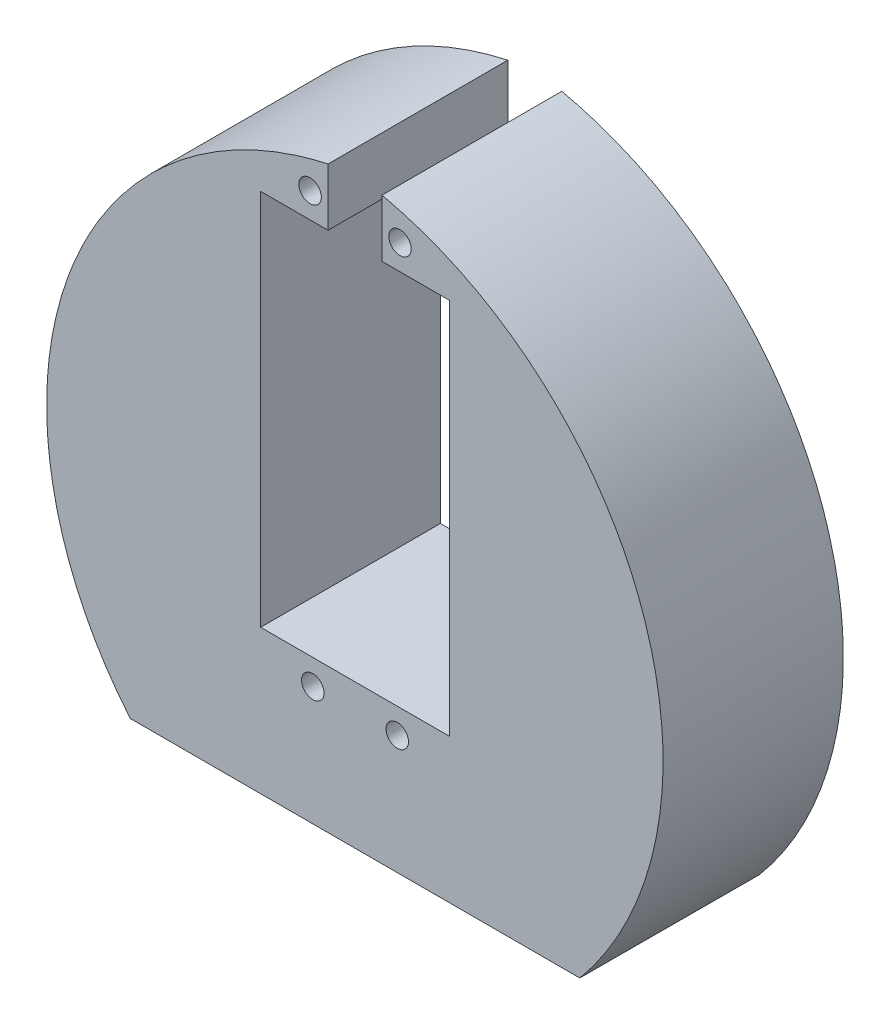
ISO-10303-21;
HEADER;
FILE_DESCRIPTION(('STEP AP214'),'2;1');
FILE_NAME('part.step','',(''),(''),'','','');
FILE_SCHEMA(('AUTOMOTIVE_DESIGN { 1 0 10303 214 1 1 1 1 }'));
ENDSEC;
DATA;
#1=APPLICATION_CONTEXT('core data for automotive mechanical design processes');
#2=APPLICATION_PROTOCOL_DEFINITION('international standard','automotive_design',2000,#1);
#3=PRODUCT_CONTEXT('',#1,'mechanical');
#4=PRODUCT('Part','Part','',(#3));
#5=PRODUCT_RELATED_PRODUCT_CATEGORY('part','',(#4));
#6=PRODUCT_DEFINITION_FORMATION('','',#4);
#7=PRODUCT_DEFINITION_CONTEXT('part definition',#1,'design');
#8=PRODUCT_DEFINITION('design','',#6,#7);
#9=PRODUCT_DEFINITION_SHAPE('','',#8);
#10=(LENGTH_UNIT() NAMED_UNIT(*) SI_UNIT(.MILLI.,.METRE.));
#11=(NAMED_UNIT(*) PLANE_ANGLE_UNIT() SI_UNIT($,.RADIAN.));
#12=(NAMED_UNIT(*) SI_UNIT($,.STERADIAN.) SOLID_ANGLE_UNIT());
#13=UNCERTAINTY_MEASURE_WITH_UNIT(LENGTH_MEASURE(1.E-05),#10,'distance_accuracy_value','');
#14=(GEOMETRIC_REPRESENTATION_CONTEXT(3) GLOBAL_UNCERTAINTY_ASSIGNED_CONTEXT((#13)) GLOBAL_UNIT_ASSIGNED_CONTEXT((#10,
#11,#12)) REPRESENTATION_CONTEXT('',''));
#15=CARTESIAN_POINT('',(0.,0.,0.));
#16=DIRECTION('',(0.,0.,1.));
#17=DIRECTION('',(1.,0.,0.));
#18=AXIS2_PLACEMENT_3D('',#15,#16,#17);
#19=CARTESIAN_POINT('',(7.55283930761335,25.5886515483538,0.));
#20=DIRECTION('',(0.,0.,-1.));
#21=DIRECTION('',(-1.,0.,0.));
#22=AXIS2_PLACEMENT_3D('',#19,#20,#21);
#23=PLANE('',#22);
#24=CARTESIAN_POINT('',(7.08333333333329,60.8887657885751,0.));
#25=DIRECTION('',(0.,0.,-1.));
#26=DIRECTION('',(-1.,0.,0.));
#27=AXIS2_PLACEMENT_3D('',#24,#25,#26);
#28=CIRCLE('',#27,1.25);
#29=CARTESIAN_POINT('',(5.83333333333329,60.8887657885751,0.));
#30=VERTEX_POINT('',#29);
#31=EDGE_CURVE('E275',#30,#30,#28,.T.);
#32=ORIENTED_EDGE('',*,*,#31,.F.);
#33=EDGE_LOOP('',(#32));
#34=FACE_BOUND('',#33,.T.);
#35=CARTESIAN_POINT('',(6.78333333333331,13.2687657885751,0.));
#36=DIRECTION('',(0.,0.,-1.));
#37=DIRECTION('',(-1.,0.,0.));
#38=AXIS2_PLACEMENT_3D('',#35,#36,#37);
#39=CIRCLE('',#38,1.25);
#40=CARTESIAN_POINT('',(5.53333333333332,13.2687657885751,0.));
#41=VERTEX_POINT('',#40);
#42=EDGE_CURVE('E278',#41,#41,#39,.T.);
#43=ORIENTED_EDGE('',*,*,#42,.F.);
#44=EDGE_LOOP('',(#43));
#45=FACE_BOUND('',#44,.T.);
#46=CARTESIAN_POINT('',(-2.91666666666672,60.8887657885751,0.));
#47=DIRECTION('',(0.,0.,-1.));
#48=DIRECTION('',(-1.,0.,0.));
#49=AXIS2_PLACEMENT_3D('',#46,#47,#48);
#50=CIRCLE('',#49,1.25);
#51=CARTESIAN_POINT('',(-4.16666666666672,60.8887657885751,0.));
#52=VERTEX_POINT('',#51);
#53=EDGE_CURVE('E340',#52,#52,#50,.T.);
#54=ORIENTED_EDGE('',*,*,#53,.F.);
#55=EDGE_LOOP('',(#54));
#56=FACE_BOUND('',#55,.T.);
#57=CARTESIAN_POINT('',(-2.61666666666669,13.2687657885751,0.));
#58=DIRECTION('',(0.,0.,-1.));
#59=DIRECTION('',(-1.,0.,0.));
#60=AXIS2_PLACEMENT_3D('',#57,#58,#59);
#61=CIRCLE('',#60,1.25);
#62=CARTESIAN_POINT('',(-3.86666666666669,13.2687657885751,0.));
#63=VERTEX_POINT('',#62);
#64=EDGE_CURVE('E343',#63,#63,#61,.T.);
#65=ORIENTED_EDGE('',*,*,#64,.F.);
#66=EDGE_LOOP('',(#65));
#67=FACE_BOUND('',#66,.T.);
#68=DIRECTION('',(0.,1.,0.));
#69=VECTOR('',#68,1.);
#70=CARTESIAN_POINT('',(-0.916666666666691,25.5886515483538,0.));
#71=LINE('',#70,#69);
#72=CARTESIAN_POINT('',(-0.916666666666691,58.0787657885751,0.));
#73=VERTEX_POINT('',#72);
#74=CARTESIAN_POINT('',(-0.916666667711149,64.4658829466267,0.));
#75=VERTEX_POINT('',#74);
#76=EDGE_CURVE('E324',#73,#75,#71,.T.);
#77=ORIENTED_EDGE('',*,*,#76,.F.);
#78=DIRECTION('',(1.,0.,0.));
#79=VECTOR('',#78,1.);
#80=CARTESIAN_POINT('',(7.55283930761335,58.0787657885751,0.));
#81=LINE('',#80,#79);
#82=CARTESIAN_POINT('',(-8.41666666666669,58.0787657885751,0.));
#83=VERTEX_POINT('',#82);
#84=EDGE_CURVE('E139',#83,#73,#81,.T.);
#85=ORIENTED_EDGE('',*,*,#84,.F.);
#86=DIRECTION('',(0.,1.,0.));
#87=VECTOR('',#86,1.);
#88=CARTESIAN_POINT('',(-8.41666666666669,25.5886515483538,0.));
#89=LINE('',#88,#87);
#90=CARTESIAN_POINT('',(-8.41666666666669,16.0787657885751,0.));
#91=VERTEX_POINT('',#90);
#92=EDGE_CURVE('E565',#91,#83,#89,.T.);
#93=ORIENTED_EDGE('',*,*,#92,.F.);
#94=DIRECTION('',(-1.,0.,0.));
#95=VECTOR('',#94,1.);
#96=CARTESIAN_POINT('',(7.55283930761335,16.0787657885751,0.));
#97=LINE('',#96,#95);
#98=CARTESIAN_POINT('',(12.5833333333333,16.0787657885751,0.));
#99=VERTEX_POINT('',#98);
#100=EDGE_CURVE('E567',#99,#91,#97,.T.);
#101=ORIENTED_EDGE('',*,*,#100,.F.);
#102=DIRECTION('',(0.,-1.,0.));
#103=VECTOR('',#102,1.);
#104=CARTESIAN_POINT('',(12.5833333333333,25.5886515483538,0.));
#105=LINE('',#104,#103);
#106=CARTESIAN_POINT('',(12.5833333333333,58.0787657885751,0.));
#107=VERTEX_POINT('',#106);
#108=EDGE_CURVE('E90',#107,#99,#105,.T.);
#109=ORIENTED_EDGE('',*,*,#108,.F.);
#110=DIRECTION('',(1.,0.,0.));
#111=VECTOR('',#110,1.);
#112=CARTESIAN_POINT('',(7.55283930761335,58.0787657885751,0.));
#113=LINE('',#112,#111);
#114=CARTESIAN_POINT('',(5.08333333333331,58.0787657885751,0.));
#115=VERTEX_POINT('',#114);
#116=EDGE_CURVE('E83',#115,#107,#113,.T.);
#117=ORIENTED_EDGE('',*,*,#116,.F.);
#118=DIRECTION('',(0.,-1.,0.));
#119=VECTOR('',#118,1.);
#120=CARTESIAN_POINT('',(5.08333333333331,25.5886515483538,0.));
#121=LINE('',#120,#119);
#122=CARTESIAN_POINT('',(5.08333679978073,64.4658733836749,0.));
#123=VERTEX_POINT('',#122);
#124=EDGE_CURVE('E178',#123,#115,#121,.T.);
#125=ORIENTED_EDGE('',*,*,#124,.F.);
#126=CARTESIAN_POINT('',(27.0833333333333,0.,0.));
#127=CARTESIAN_POINT('',(28.0164012844011,1.11104406794344,0.));
#128=CARTESIAN_POINT('',(28.9190259195694,2.30928683080672,0.));
#129=CARTESIAN_POINT('',(30.6261481939105,4.88317625524152,0.));
#130=CARTESIAN_POINT('',(31.4305766569821,6.25891254203251,0.));
#131=CARTESIAN_POINT('',(32.8995388497775,9.18158040999259,0.));
#132=CARTESIAN_POINT('',(33.5639583336707,10.7285826734488,0.));
#133=CARTESIAN_POINT('',(34.7094048513414,13.9756932027226,0.));
#134=CARTESIAN_POINT('',(35.1902777590617,15.6758286802819,0.));
#135=CARTESIAN_POINT('',(35.9274627197019,19.1976690410992,0.));
#136=CARTESIAN_POINT('',(36.1836007787578,21.0193344977234,0.));
#137=CARTESIAN_POINT('',(36.4374926093151,24.7393501701483,0.));
#138=CARTESIAN_POINT('',(36.4350868691065,26.6375825214167,0.));
#139=CARTESIAN_POINT('',(36.1505606018148,30.4548296836023,0.));
#140=CARTESIAN_POINT('',(35.8683357593564,32.3736571666079,0.));
#141=CARTESIAN_POINT('',(35.0194492091741,36.1698112813286,0.));
#142=CARTESIAN_POINT('',(34.4527711483946,38.0469136065345,0.));
#143=CARTESIAN_POINT('',(33.0487859839432,41.6972750341082,0.));
#144=CARTESIAN_POINT('',(32.2115609245384,43.4703208213813,0.));
#145=CARTESIAN_POINT('',(30.2978476684176,46.8569262030487,0.));
#146=CARTESIAN_POINT('',(29.2215219185376,48.470330260123,0.));
#147=CARTESIAN_POINT('',(26.8747675443411,51.4944127658068,0.));
#148=CARTESIAN_POINT('',(25.6045418790068,52.9050220689499,0.));
#149=CARTESIAN_POINT('',(22.9232920799579,55.4961371146031,0.));
#150=CARTESIAN_POINT('',(21.5124653280754,56.676662259328,0.));
#151=CARTESIAN_POINT('',(18.6052803732381,58.7968218834232,0.));
#152=CARTESIAN_POINT('',(17.1090777402772,59.7365436914897,0.));
#153=CARTESIAN_POINT('',(14.0829505889876,61.3792028096248,0.));
#154=CARTESIAN_POINT('',(12.5531222388334,62.0822635984475,0.));
#155=CARTESIAN_POINT('',(9.50426977183667,63.2673104434106,0.));
#156=CARTESIAN_POINT('',(7.98528309160405,63.7494255212384,0.));
#157=CARTESIAN_POINT('',(4.99336952108008,64.515993466879,0.));
#158=CARTESIAN_POINT('',(3.52043391986124,64.8005592157472,0.));
#159=CARTESIAN_POINT('',(2.08333333333333,65.,0.));
#160=B_SPLINE_CURVE_WITH_KNOTS('',3,(#126,#127,#128,#129,#130,#131,#132,#133,#134,#135,#136,
#137,#138,#139,#140,#141,#142,#143,#144,#145,#146,#147,#148,#149,#150,#151,#152,#153,#154,#155,
#156,#157,#158,#159),.UNSPECIFIED.,.F.,.F.,(4,2,2,2,2,2,2,2,2,2,2,2,2,2,2,2,4),(0.,0.0625,0.125,
0.1875,0.25,0.3125,0.375,0.4375,0.5,0.5625,0.625,0.6875,0.75,0.8125,0.875,0.9375,1.),.UNSPECIFIED.);
#161=CARTESIAN_POINT('',(27.0833333333333,0.,0.));
#162=VERTEX_POINT('',#161);
#163=EDGE_CURVE('E77',#162,#123,#160,.T.);
#164=ORIENTED_EDGE('',*,*,#163,.F.);
#165=DIRECTION('',(1.,0.,0.));
#166=VECTOR('',#165,1.);
#167=CARTESIAN_POINT('',(-22.9166666666667,0.,0.));
#168=LINE('',#167,#166);
#169=CARTESIAN_POINT('',(-22.9166666666667,0.,0.));
#170=VERTEX_POINT('',#169);
#171=EDGE_CURVE('E305',#170,#162,#168,.T.);
#172=ORIENTED_EDGE('',*,*,#171,.F.);
#173=CARTESIAN_POINT('',(2.08333333333336,65.,0.));
#174=CARTESIAN_POINT('',(0.646232746805447,64.8005592157472,0.));
#175=CARTESIAN_POINT('',(-0.826702854413394,64.515993466879,0.));
#176=CARTESIAN_POINT('',(-3.81861642493735,63.7494255212385,0.));
#177=CARTESIAN_POINT('',(-5.33760310516998,63.2673104434106,0.));
#178=CARTESIAN_POINT('',(-8.38645557216667,62.0822635984475,0.));
#179=CARTESIAN_POINT('',(-9.9162839223209,61.3792028096249,0.));
#180=CARTESIAN_POINT('',(-12.9424110736105,59.7365436914897,0.));
#181=CARTESIAN_POINT('',(-14.4386137065714,58.7968218834232,0.));
#182=CARTESIAN_POINT('',(-17.3457986614088,56.676662259328,0.));
#183=CARTESIAN_POINT('',(-18.7566254132912,55.4961371146031,0.));
#184=CARTESIAN_POINT('',(-21.4378752123401,52.9050220689499,0.));
#185=CARTESIAN_POINT('',(-22.7081008776744,51.4944127658068,0.));
#186=CARTESIAN_POINT('',(-25.054855251871,48.470330260123,0.));
#187=CARTESIAN_POINT('',(-26.1311810017509,46.8569262030488,0.));
#188=CARTESIAN_POINT('',(-28.0448942578718,43.4703208213814,0.));
#189=CARTESIAN_POINT('',(-28.8821193172765,41.6972750341083,0.));
#190=CARTESIAN_POINT('',(-30.286104481728,38.0469136065345,0.));
#191=CARTESIAN_POINT('',(-30.8527825425075,36.1698112813286,0.));
#192=CARTESIAN_POINT('',(-31.7016690926897,32.3736571666079,0.));
#193=CARTESIAN_POINT('',(-31.9838939351482,30.4548296836023,0.));
#194=CARTESIAN_POINT('',(-32.2684202024399,26.6375825214167,0.));
#195=CARTESIAN_POINT('',(-32.2708259426485,24.7393501701483,0.));
#196=CARTESIAN_POINT('',(-32.0169341120911,21.0193344977235,0.));
#197=CARTESIAN_POINT('',(-31.7607960530353,19.1976690410992,0.));
#198=CARTESIAN_POINT('',(-31.023611092395,15.6758286802819,0.));
#199=CARTESIAN_POINT('',(-30.5427381846748,13.9756932027226,0.));
#200=CARTESIAN_POINT('',(-29.397291667004,10.7285826734488,0.));
#201=CARTESIAN_POINT('',(-28.7328721831109,9.18158040999259,0.));
#202=CARTESIAN_POINT('',(-27.2639099903154,6.25891254203252,0.));
#203=CARTESIAN_POINT('',(-26.4594815272439,4.88317625524153,0.));
#204=CARTESIAN_POINT('',(-24.7523592529028,2.30928683080673,0.));
#205=CARTESIAN_POINT('',(-23.8497346177345,1.11104406794345,0.));
#206=CARTESIAN_POINT('',(-22.9166666666667,0.,0.));
#207=B_SPLINE_CURVE_WITH_KNOTS('',3,(#173,#174,#175,#176,#177,#178,#179,#180,#181,#182,#183,
#184,#185,#186,#187,#188,#189,#190,#191,#192,#193,#194,#195,#196,#197,#198,#199,#200,#201,#202,
#203,#204,#205,#206),.UNSPECIFIED.,.F.,.F.,(4,2,2,2,2,2,2,2,2,2,2,2,2,2,2,2,4),(0.,0.0625,0.125,
0.1875,0.25,0.3125,0.375,0.4375,0.5,0.5625,0.625,0.6875,0.75,0.8125,0.875,0.9375,1.),.UNSPECIFIED.);
#208=EDGE_CURVE('E246',#75,#170,#207,.T.);
#209=ORIENTED_EDGE('',*,*,#208,.F.);
#210=EDGE_LOOP('',(#77,#85,#93,#101,#109,#117,#125,#164,#172,#209));
#211=FACE_BOUND('',#210,.T.);
#212=ADVANCED_FACE('F35',(#34,#45,#56,#67,#211),#23,.T.);
#213=CARTESIAN_POINT('',(0.,0.,0.));
#214=DIRECTION('',(0.,0.999997837007663,-0.00207989903491139));
#215=DIRECTION('',(0.,0.00207989903491139,0.999997837007663));
#216=AXIS2_PLACEMENT_3D('',#213,#214,#215);
#217=PLANE('',#216);
#218=CARTESIAN_POINT('',(-14.9166666666667,0.020799035337268,10.));
#219=DIRECTION('',(0.,0.999997837007663,-0.00207989903491139));
#220=DIRECTION('',(0.,-0.00207989903491139,-0.999997837007663));
#221=AXIS2_PLACEMENT_3D('',#218,#219,#220);
#222=ELLIPSE('',#221,7.00001514097911,7.);
#223=CARTESIAN_POINT('',(-14.9166666666667,0.0062397106011804,3.));
#224=VERTEX_POINT('',#223);
#225=EDGE_CURVE('E39',#224,#224,#222,.F.);
#226=ORIENTED_EDGE('',*,*,#225,.F.);
#227=EDGE_LOOP('',(#226));
#228=FACE_BOUND('',#227,.T.);
#229=CARTESIAN_POINT('',(19.0833333333333,0.020799035337268,10.));
#230=DIRECTION('',(0.,0.999997837007663,-0.00207989903491139));
#231=DIRECTION('',(0.,-0.00207989903491139,-0.999997837007663));
#232=AXIS2_PLACEMENT_3D('',#229,#230,#231);
#233=ELLIPSE('',#232,7.00001514097911,7.);
#234=CARTESIAN_POINT('',(19.0833333333333,0.0062397106011804,3.));
#235=VERTEX_POINT('',#234);
#236=EDGE_CURVE('E248',#235,#235,#233,.F.);
#237=ORIENTED_EDGE('',*,*,#236,.F.);
#238=EDGE_LOOP('',(#237));
#239=FACE_BOUND('',#238,.T.);
#240=DIRECTION('',(0.,-0.0020798990349107,-0.999997837007663));
#241=VECTOR('',#240,1.);
#242=CARTESIAN_POINT('',(27.0833333333333,0.0207990353372611,10.));
#243=LINE('',#242,#241);
#244=CARTESIAN_POINT('',(27.0833333333333,0.0415980706745256,20.));
#245=VERTEX_POINT('',#244);
#246=EDGE_CURVE('E267',#245,#162,#243,.T.);
#247=ORIENTED_EDGE('',*,*,#246,.F.);
#248=DIRECTION('',(1.,0.,0.));
#249=VECTOR('',#248,1.);
#250=CARTESIAN_POINT('',(-22.9166666666667,0.041598070674536,20.));
#251=LINE('',#250,#249);
#252=CARTESIAN_POINT('',(-22.9166666666667,0.0415980706745304,20.));
#253=VERTEX_POINT('',#252);
#254=EDGE_CURVE('E286',#253,#245,#251,.T.);
#255=ORIENTED_EDGE('',*,*,#254,.F.);
#256=DIRECTION('',(0.,0.00207989903491058,0.999997837007663));
#257=VECTOR('',#256,1.);
#258=CARTESIAN_POINT('',(-22.9166666666667,0.0207990353372668,10.));
#259=LINE('',#258,#257);
#260=EDGE_CURVE('E269',#170,#253,#259,.T.);
#261=ORIENTED_EDGE('',*,*,#260,.F.);
#262=ORIENTED_EDGE('',*,*,#171,.T.);
#263=EDGE_LOOP('',(#247,#255,#261,#262));
#264=FACE_BOUND('',#263,.T.);
#265=ADVANCED_FACE('F323',(#228,#239,#264),#217,.F.);
#266=CARTESIAN_POINT('',(2.08333333333336,65.,0.));
#267=CARTESIAN_POINT('',(2.0833333333333,65.,20.));
#268=CARTESIAN_POINT('',(0.646232746805447,64.8005592157472,0.));
#269=CARTESIAN_POINT('',(0.647068042808177,64.8004245126932,20.));
#270=CARTESIAN_POINT('',(-0.826702854413394,64.515993466879,0.));
#271=CARTESIAN_POINT('',(-0.824969306393045,64.5157862336389,20.));
#272=CARTESIAN_POINT('',(-3.81861642493735,63.7494255212385,0.));
#273=CARTESIAN_POINT('',(-3.81497817688383,63.7492452227209,20.));
#274=CARTESIAN_POINT('',(-5.33760310516998,63.2673104434106,0.));
#275=CARTESIAN_POINT('',(-5.33295829527234,63.2672298269595,20.));
#276=CARTESIAN_POINT('',(-8.38645557216667,62.0822635984475,0.));
#277=CARTESIAN_POINT('',(-8.37972534279391,62.082602260037,20.));
#278=CARTESIAN_POINT('',(-9.9162839223209,61.3792028096249,0.));
#279=CARTESIAN_POINT('',(-9.90847481691595,61.3798613678849,20.));
#280=CARTESIAN_POINT('',(-12.9424110736105,59.7365436914897,0.));
#281=CARTESIAN_POINT('',(-12.9324285277208,59.7381020595464,20.));
#282=CARTESIAN_POINT('',(-14.4386137065714,58.7968218834232,0.));
#283=CARTESIAN_POINT('',(-14.4275367318427,58.7989605005638,20.));
#284=CARTESIAN_POINT('',(-17.3457986614088,56.676662259328,0.));
#285=CARTESIAN_POINT('',(-17.3325929114633,56.6802438942865,20.));
#286=CARTESIAN_POINT('',(-18.7566254132912,55.4961371146031,0.));
#287=CARTESIAN_POINT('',(-18.7423856359939,55.5005817987251,20.));
#288=CARTESIAN_POINT('',(-21.4378752123401,52.9050220689499,0.));
#289=CARTESIAN_POINT('',(-21.4217156437159,52.9114706392574,20.));
#290=CARTESIAN_POINT('',(-22.7081008776744,51.4944127658068,0.));
#291=CARTESIAN_POINT('',(-22.691056015247,51.5020022864811,20.));
#292=CARTESIAN_POINT('',(-25.054855251871,48.470330260123,0.));
#293=CARTESIAN_POINT('',(-25.0362766180437,48.4804411631434,20.));
#294=CARTESIAN_POINT('',(-26.1311810017509,46.8569262030488,0.));
#295=CARTESIAN_POINT('',(-26.1119544050575,46.8684173995493,20.));
#296=CARTESIAN_POINT('',(-28.0448942578718,43.4703208213814,0.));
#297=CARTESIAN_POINT('',(-28.0246822210199,43.4847403104406,20.));
#298=CARTESIAN_POINT('',(-28.8821193172765,41.6972750341083,0.));
#299=CARTESIAN_POINT('',(-28.8615702092453,41.7132421263521,20.));
#300=CARTESIAN_POINT('',(-30.286104481728,38.0469136065345,0.));
#301=CARTESIAN_POINT('',(-30.2652360786822,38.0660464574978,20.));
#302=CARTESIAN_POINT('',(-30.8527825425075,36.1698112813286,0.));
#303=CARTESIAN_POINT('',(-30.8319320780123,36.1905617293786,20.));
#304=CARTESIAN_POINT('',(-31.7016690926897,32.3736571666079,0.));
#305=CARTESIAN_POINT('',(-31.6812154108716,32.3976056049497,20.));
#306=CARTESIAN_POINT('',(-31.9838939351482,30.4548296836023,0.));
#307=CARTESIAN_POINT('',(-31.9638189652964,30.480357956133,20.));
#308=CARTESIAN_POINT('',(-32.2684202024399,26.6375825214167,0.));
#309=CARTESIAN_POINT('',(-32.2494307703576,26.6661323211373,20.));
#310=CARTESIAN_POINT('',(-32.2708259426485,24.7393501701483,0.));
#311=CARTESIAN_POINT('',(-32.252542966913,24.7693412597631,20.));
#312=CARTESIAN_POINT('',(-32.0169341120911,21.0193344977235,0.));
#313=CARTESIAN_POINT('',(-32.0003283628913,21.0519909023341,20.));
#314=CARTESIAN_POINT('',(-31.7607960530353,19.1976690410992,0.));
#315=CARTESIAN_POINT('',(-31.7451605985885,19.231549308131,20.));
#316=CARTESIAN_POINT('',(-31.023611092395,15.6758286802819,0.));
#317=CARTESIAN_POINT('',(-31.0100989550509,15.7118908240353,20.));
#318=CARTESIAN_POINT('',(-30.5427381846748,13.9756932027226,0.));
#319=CARTESIAN_POINT('',(-30.53037862803,14.0127134296224,20.));
#320=CARTESIAN_POINT('',(-29.397291667004,10.7285826734488,0.));
#321=CARTESIAN_POINT('',(-29.3873349016239,10.7672364675828,20.));
#322=CARTESIAN_POINT('',(-28.7328721831109,9.18158040999259,0.));
#323=CARTESIAN_POINT('',(-28.7241653141022,9.22090991270589,20.));
#324=CARTESIAN_POINT('',(-27.2639099903154,6.25891254203252,0.));
#325=CARTESIAN_POINT('',(-27.2577235777479,6.29932120995286,20.));
#326=CARTESIAN_POINT('',(-26.4594815272439,4.88317625524153,0.));
#327=CARTESIAN_POINT('',(-26.4545655171243,4.92398866426464,20.));
#328=CARTESIAN_POINT('',(-24.7523592529028,2.30928683080673,0.));
#329=CARTESIAN_POINT('',(-24.7499430105661,2.35066391267032,20.));
#330=CARTESIAN_POINT('',(-23.8497346177345,1.11104406794345,0.));
#331=CARTESIAN_POINT('',(-23.8485477180546,1.15258234867539,20.));
#332=CARTESIAN_POINT('',(-22.9166666666667,0.,0.));
#333=CARTESIAN_POINT('',(-22.9166666666667,0.0415980706745266,20.));
#334=B_SPLINE_SURFACE_WITH_KNOTS('',3,1,((#266,#267),(#268,#269),(#270,#271),(#272,#273),(#274,
#275),(#276,#277),(#278,#279),(#280,#281),(#282,#283),(#284,#285),(#286,#287),(#288,#289),(#290,
#291),(#292,#293),(#294,#295),(#296,#297),(#298,#299),(#300,#301),(#302,#303),(#304,#305),(#306,
#307),(#308,#309),(#310,#311),(#312,#313),(#314,#315),(#316,#317),(#318,#319),(#320,#321),(#322,
#323),(#324,#325),(#326,#327),(#328,#329),(#330,#331),(#332,#333)),.UNSPECIFIED.,.F.,.F.,.F.,(4,
2,2,2,2,2,2,2,2,2,2,2,2,2,2,2,4),(2,2),(0.,0.0625,0.125,0.1875,0.25,0.3125,0.375,0.4375,0.5,
0.5625,0.625,0.6875,0.75,0.8125,0.875,0.9375,1.),(0.,1.),.UNSPECIFIED.);
#335=CARTESIAN_POINT('',(-0.916666666666465,64.4658574763208,0.));
#336=CARTESIAN_POINT('',(-0.916666666666597,64.4658096145378,1.66667027097447));
#337=CARTESIAN_POINT('',(-0.916666666666663,64.4657617457999,3.33334054194874));
#338=CARTESIAN_POINT('',(-0.916666666666719,64.4656659944079,6.66668108389688));
#339=CARTESIAN_POINT('',(-0.916666666666709,64.4656181117538,8.33335135487075));
#340=CARTESIAN_POINT('',(-0.916666666666653,64.4654744433223,13.3333477505637));
#341=CARTESIAN_POINT('',(-0.916666666666577,64.4653786366615,16.6666738752823));
#342=CARTESIAN_POINT('',(-0.916666666666691,64.4652828021311,20.));
#343=B_SPLINE_CURVE_WITH_KNOTS('',3,(#335,#336,#337,#338,#339,#340,#341,#342),.UNSPECIFIED.,.F.,
.F.,(4,2,2,4),(0.,5.00001081498508,10.0000216299702,20.0000000082563),.UNSPECIFIED.);
#344=CARTESIAN_POINT('',(-0.916666666666691,64.4653267010203,20.));
#345=VERTEX_POINT('',#344);
#346=EDGE_CURVE('E147',#75,#345,#343,.T.);
#347=CARTESIAN_POINT('',(-22.9166666666667,0.0415980706745266,20.));
#348=CARTESIAN_POINT('',(-23.8485477180546,1.15258234867539,20.));
#349=CARTESIAN_POINT('',(-24.7499430105661,2.35066391267032,20.));
#350=CARTESIAN_POINT('',(-26.4545655171243,4.92398866426464,20.));
#351=CARTESIAN_POINT('',(-27.2577235777479,6.29932120995286,20.));
#352=CARTESIAN_POINT('',(-28.7241653141022,9.22090991270589,20.));
#353=CARTESIAN_POINT('',(-29.3873349016239,10.7672364675828,20.));
#354=CARTESIAN_POINT('',(-30.53037862803,14.0127134296224,20.));
#355=CARTESIAN_POINT('',(-31.0100989550509,15.7118908240353,20.));
#356=CARTESIAN_POINT('',(-31.7451605985885,19.231549308131,20.));
#357=CARTESIAN_POINT('',(-32.0003283628913,21.0519909023341,20.));
#358=CARTESIAN_POINT('',(-32.252542966913,24.7693412597631,20.));
#359=CARTESIAN_POINT('',(-32.2494307703576,26.6661323211373,20.));
#360=CARTESIAN_POINT('',(-31.9638189652964,30.480357956133,20.));
#361=CARTESIAN_POINT('',(-31.6812154108716,32.3976056049497,20.));
#362=CARTESIAN_POINT('',(-30.8319320780123,36.1905617293786,20.));
#363=CARTESIAN_POINT('',(-30.2652360786822,38.0660464574978,20.));
#364=CARTESIAN_POINT('',(-28.8615702092453,41.7132421263521,20.));
#365=CARTESIAN_POINT('',(-28.0246822210199,43.4847403104406,20.));
#366=CARTESIAN_POINT('',(-26.1119544050575,46.8684173995493,20.));
#367=CARTESIAN_POINT('',(-25.0362766180437,48.4804411631434,20.));
#368=CARTESIAN_POINT('',(-22.691056015247,51.5020022864811,20.));
#369=CARTESIAN_POINT('',(-21.4217156437159,52.9114706392574,20.));
#370=CARTESIAN_POINT('',(-18.7423856359939,55.5005817987251,20.));
#371=CARTESIAN_POINT('',(-17.3325929114633,56.6802438942865,20.));
#372=CARTESIAN_POINT('',(-14.4275367318427,58.7989605005638,20.));
#373=CARTESIAN_POINT('',(-12.9324285277208,59.7381020595464,20.));
#374=CARTESIAN_POINT('',(-9.90847481691595,61.3798613678849,20.));
#375=CARTESIAN_POINT('',(-8.37972534279391,62.082602260037,20.));
#376=CARTESIAN_POINT('',(-5.33295829527234,63.2672298269595,20.));
#377=CARTESIAN_POINT('',(-3.81497817688383,63.7492452227209,20.));
#378=CARTESIAN_POINT('',(-0.824969306393045,64.5157862336389,20.));
#379=CARTESIAN_POINT('',(0.647068042808177,64.8004245126932,20.));
#380=CARTESIAN_POINT('',(2.0833333333333,65.,20.));
#381=B_SPLINE_CURVE_WITH_KNOTS('',3,(#347,#348,#349,#350,#351,#352,#353,#354,#355,#356,#357,
#358,#359,#360,#361,#362,#363,#364,#365,#366,#367,#368,#369,#370,#371,#372,#373,#374,#375,#376,
#377,#378,#379,#380),.UNSPECIFIED.,.F.,.F.,(4,2,2,2,2,2,2,2,2,2,2,2,2,2,2,2,4),(0.,0.0625,0.125,
0.1875,0.25,0.3125,0.375,0.4375,0.5,0.5625,0.625,0.6875,0.75,0.8125,0.875,0.9375,1.),.UNSPECIFIED.);
#382=EDGE_CURVE('E235',#345,#253,#381,.F.);
#383=ORIENTED_EDGE('',*,*,#346,.F.);
#384=ORIENTED_EDGE('',*,*,#208,.T.);
#385=ORIENTED_EDGE('',*,*,#260,.T.);
#386=ORIENTED_EDGE('',*,*,#382,.F.);
#387=EDGE_LOOP('',(#383,#384,#385,#386));
#388=FACE_BOUND('',#387,.T.);
#389=ADVANCED_FACE('F330',(#388),#334,.T.);
#390=CARTESIAN_POINT('',(27.0833333333333,0.,0.));
#391=CARTESIAN_POINT('',(27.0833333333333,0.0415980706745221,20.));
#392=CARTESIAN_POINT('',(28.0164012844011,1.11104406794344,0.));
#393=CARTESIAN_POINT('',(28.0133244743016,1.15416484962377,20.));
#394=CARTESIAN_POINT('',(28.9190259195694,2.30928683080672,0.));
#395=CARTESIAN_POINT('',(28.9126509532031,2.35362476622195,20.));
#396=CARTESIAN_POINT('',(30.6261481939105,4.88317625524152,0.));
#397=CARTESIAN_POINT('',(30.6128826007801,4.92916707381524,20.));
#398=CARTESIAN_POINT('',(31.4305766569821,6.25891254203251,0.));
#399=CARTESIAN_POINT('',(31.4137186337123,6.30533793420842,20.));
#400=CARTESIAN_POINT('',(32.8995388497775,9.18158040999259,0.));
#401=CARTESIAN_POINT('',(32.8754252954175,9.22795929915275,20.));
#402=CARTESIAN_POINT('',(33.5639583336707,10.7285826734488,0.));
#403=CARTESIAN_POINT('',(33.5361823179706,10.7744792345085,20.));
#404=CARTESIAN_POINT('',(34.7094048513414,13.9756932027226,0.));
#405=CARTESIAN_POINT('',(34.6745234227474,14.0196500755094,20.));
#406=CARTESIAN_POINT('',(35.1902777590617,15.6758286802819,0.));
#407=CARTESIAN_POINT('',(35.1519547227564,15.7183271974952,20.));
#408=CARTESIAN_POINT('',(35.9274627197019,19.1976690410992,0.));
#409=CARTESIAN_POINT('',(35.8828031711772,19.2363264932348,20.));
#410=CARTESIAN_POINT('',(36.1836007787578,21.0193344977234,0.));
#411=CARTESIAN_POINT('',(36.1360482430832,21.0556089400319,20.));
#412=CARTESIAN_POINT('',(36.4374926093151,24.7393501701483,0.));
#413=CARTESIAN_POINT('',(36.3850152883598,24.7701161289486,20.));
#414=CARTESIAN_POINT('',(36.4350868691065,26.6375825214167,0.));
#415=CARTESIAN_POINT('',(36.380579809062,26.6652237474288,20.));
#416=CARTESIAN_POINT('',(36.1505606018148,30.4548296836023,0.));
#417=CARTESIAN_POINT('',(36.0930954173916,30.4757866035136,20.));
#418=CARTESIAN_POINT('',(35.8683357593564,32.3736571666079,0.));
#419=CARTESIAN_POINT('',(35.8099437465324,32.3910563257548,20.));
#420=CARTESIAN_POINT('',(35.0194492091741,36.1698112813286,0.));
#421=CARTESIAN_POINT('',(34.9604138986986,36.1800548397006,20.));
#422=CARTESIAN_POINT('',(34.4527711483946,38.0469136065345,0.));
#423=CARTESIAN_POINT('',(34.3940198283126,38.0535618025227,20.));
#424=CARTESIAN_POINT('',(33.0487859839432,41.6972750341082,0.));
#425=CARTESIAN_POINT('',(32.9917585109456,41.6971079730615,20.));
#426=CARTESIAN_POINT('',(32.2115609245384,43.4703208213813,0.));
#427=CARTESIAN_POINT('',(32.1559724337803,43.4669362743178,20.));
#428=CARTESIAN_POINT('',(30.2978476684176,46.8569262030487,0.));
#429=CARTESIAN_POINT('',(30.2460807943724,46.8478421627985,20.));
#430=CARTESIAN_POINT('',(29.2215219185376,48.470330260123,0.));
#431=CARTESIAN_POINT('',(29.1721357435884,48.4587658126159,20.));
#432=CARTESIAN_POINT('',(26.8747675443411,51.4944127658068,0.));
#433=CARTESIAN_POINT('',(26.8307601692626,51.4788646480149,20.));
#434=CARTESIAN_POINT('',(25.6045418790068,52.9050220689499,0.));
#435=CARTESIAN_POINT('',(25.5635302640013,52.8879710763266,20.));
#436=CARTESIAN_POINT('',(22.9232920799579,55.4961371146031,0.));
#437=CARTESIAN_POINT('',(22.8885160027276,55.4771498936604,20.));
#438=CARTESIAN_POINT('',(21.5124653280754,56.676662259328,0.));
#439=CARTESIAN_POINT('',(21.4809269957249,56.6572409388911,20.));
#440=CARTESIAN_POINT('',(18.6052803732381,58.7968218834232,0.));
#441=CARTESIAN_POINT('',(18.5801092800691,58.7775510765647,20.));
#442=CARTESIAN_POINT('',(17.1090777402772,59.7365436914897,0.));
#443=CARTESIAN_POINT('',(17.0870348826249,59.7178560561766,20.));
#444=CARTESIAN_POINT('',(14.0829505889876,61.3792028096248,0.));
#445=CARTESIAN_POINT('',(14.0667756552273,61.362540967467,20.));
#446=CARTESIAN_POINT('',(12.5531222388334,62.0822635984475,0.));
#447=CARTESIAN_POINT('',(12.5396866106899,62.0670427796434,20.));
#448=CARTESIAN_POINT('',(9.50426977183667,63.2673104434106,0.));
#449=CARTESIAN_POINT('',(9.49574057698362,63.2556110576932,20.));
#450=CARTESIAN_POINT('',(7.98528309160405,63.7494255212384,0.));
#451=CARTESIAN_POINT('',(7.97892133350189,63.739805203921,20.));
#452=CARTESIAN_POINT('',(4.99336952108008,64.515993466879,0.));
#453=CARTESIAN_POINT('',(4.99068369721675,64.510935324403,20.));
#454=CARTESIAN_POINT('',(3.52043391986124,64.8005592157472,0.));
#455=CARTESIAN_POINT('',(3.51925728999369,64.7979832913106,20.));
#456=CARTESIAN_POINT('',(2.08333333333333,65.,0.));
#457=CARTESIAN_POINT('',(2.08333333333328,65.,20.));
#458=B_SPLINE_SURFACE_WITH_KNOTS('',3,1,((#390,#391),(#392,#393),(#394,#395),(#396,#397),(#398,
#399),(#400,#401),(#402,#403),(#404,#405),(#406,#407),(#408,#409),(#410,#411),(#412,#413),(#414,
#415),(#416,#417),(#418,#419),(#420,#421),(#422,#423),(#424,#425),(#426,#427),(#428,#429),(#430,
#431),(#432,#433),(#434,#435),(#436,#437),(#438,#439),(#440,#441),(#442,#443),(#444,#445),(#446,
#447),(#448,#449),(#450,#451),(#452,#453),(#454,#455),(#456,#457)),.UNSPECIFIED.,.F.,.F.,.F.,(4,
2,2,2,2,2,2,2,2,2,2,2,2,2,2,2,4),(2,2),(0.,0.0625,0.125,0.1875,0.25,0.3125,0.375,0.4375,0.5,
0.5625,0.625,0.6875,0.75,0.8125,0.875,0.9375,1.),(0.,1.),.UNSPECIFIED.);
#459=CARTESIAN_POINT('',(5.08333333333309,64.4600956249283,20.));
#460=CARTESIAN_POINT('',(5.08333333333322,64.4605762388805,18.3333256079817));
#461=CARTESIAN_POINT('',(5.08333333333328,64.4610567383464,16.6666512159303));
#462=CARTESIAN_POINT('',(5.08333333333334,64.4620175084927,13.3333024317617));
#463=CARTESIAN_POINT('',(5.08333333333333,64.4624977791733,11.6666280396444));
#464=CARTESIAN_POINT('',(5.08333333333328,64.463938239415,6.66663576512777));
#465=CARTESIAN_POINT('',(5.08333333333321,64.4648980860874,3.33331788262957));
#466=CARTESIAN_POINT('',(5.08333333333332,64.4658574763207,0.));
#467=B_SPLINE_CURVE_WITH_KNOTS('',3,(#459,#460,#461,#462,#463,#464,#465,#466),.UNSPECIFIED.,.F.,
.F.,(4,2,2,4),(0.,5.00002338394479,10.0000467678896,20.0000008299735),.UNSPECIFIED.);
#468=CARTESIAN_POINT('',(5.08333333333331,64.4601498866902,20.));
#469=VERTEX_POINT('',#468);
#470=EDGE_CURVE('E170',#469,#123,#467,.T.);
#471=CARTESIAN_POINT('',(2.08333333333328,65.,20.));
#472=CARTESIAN_POINT('',(3.51925728999369,64.7979832913106,20.));
#473=CARTESIAN_POINT('',(4.99068369721675,64.510935324403,20.));
#474=CARTESIAN_POINT('',(7.97892133350189,63.739805203921,20.));
#475=CARTESIAN_POINT('',(9.49574057698362,63.2556110576932,20.));
#476=CARTESIAN_POINT('',(12.5396866106899,62.0670427796434,20.));
#477=CARTESIAN_POINT('',(14.0667756552273,61.362540967467,20.));
#478=CARTESIAN_POINT('',(17.0870348826249,59.7178560561766,20.));
#479=CARTESIAN_POINT('',(18.5801092800691,58.7775510765647,20.));
#480=CARTESIAN_POINT('',(21.4809269957249,56.6572409388911,20.));
#481=CARTESIAN_POINT('',(22.8885160027276,55.4771498936604,20.));
#482=CARTESIAN_POINT('',(25.5635302640013,52.8879710763266,20.));
#483=CARTESIAN_POINT('',(26.8307601692626,51.4788646480149,20.));
#484=CARTESIAN_POINT('',(29.1721357435884,48.4587658126159,20.));
#485=CARTESIAN_POINT('',(30.2460807943724,46.8478421627985,20.));
#486=CARTESIAN_POINT('',(32.1559724337803,43.4669362743178,20.));
#487=CARTESIAN_POINT('',(32.9917585109456,41.6971079730615,20.));
#488=CARTESIAN_POINT('',(34.3940198283126,38.0535618025227,20.));
#489=CARTESIAN_POINT('',(34.9604138986986,36.1800548397006,20.));
#490=CARTESIAN_POINT('',(35.8099437465324,32.3910563257548,20.));
#491=CARTESIAN_POINT('',(36.0930954173916,30.4757866035136,20.));
#492=CARTESIAN_POINT('',(36.380579809062,26.6652237474288,20.));
#493=CARTESIAN_POINT('',(36.3850152883598,24.7701161289486,20.));
#494=CARTESIAN_POINT('',(36.1360482430832,21.0556089400319,20.));
#495=CARTESIAN_POINT('',(35.8828031711772,19.2363264932348,20.));
#496=CARTESIAN_POINT('',(35.1519547227564,15.7183271974952,20.));
#497=CARTESIAN_POINT('',(34.6745234227474,14.0196500755094,20.));
#498=CARTESIAN_POINT('',(33.5361823179706,10.7744792345085,20.));
#499=CARTESIAN_POINT('',(32.8754252954175,9.22795929915275,20.));
#500=CARTESIAN_POINT('',(31.4137186337123,6.30533793420842,20.));
#501=CARTESIAN_POINT('',(30.6128826007801,4.92916707381524,20.));
#502=CARTESIAN_POINT('',(28.9126509532031,2.35362476622195,20.));
#503=CARTESIAN_POINT('',(28.0133244743016,1.15416484962377,20.));
#504=CARTESIAN_POINT('',(27.0833333333333,0.0415980706745221,20.));
#505=B_SPLINE_CURVE_WITH_KNOTS('',3,(#471,#472,#473,#474,#475,#476,#477,#478,#479,#480,#481,
#482,#483,#484,#485,#486,#487,#488,#489,#490,#491,#492,#493,#494,#495,#496,#497,#498,#499,#500,
#501,#502,#503,#504),.UNSPECIFIED.,.F.,.F.,(4,2,2,2,2,2,2,2,2,2,2,2,2,2,2,2,4),(0.,
0.0625000000000001,0.125,0.1875,0.25,0.3125,0.375,0.4375,0.5,0.5625,0.625,0.6875,0.75,0.8125,
0.875,0.9375,1.),.UNSPECIFIED.);
#506=EDGE_CURVE('E44',#245,#469,#505,.F.);
#507=ORIENTED_EDGE('',*,*,#470,.F.);
#508=ORIENTED_EDGE('',*,*,#506,.F.);
#509=ORIENTED_EDGE('',*,*,#246,.T.);
#510=ORIENTED_EDGE('',*,*,#163,.T.);
#511=EDGE_LOOP('',(#507,#508,#509,#510));
#512=FACE_BOUND('',#511,.T.);
#513=ADVANCED_FACE('F188',(#512),#458,.T.);
#514=CARTESIAN_POINT('',(7.55770140352719,25.6031534589613,20.));
#515=DIRECTION('',(0.,0.,-1.));
#516=DIRECTION('',(-1.,0.,0.));
#517=AXIS2_PLACEMENT_3D('',#514,#515,#516);
#518=PLANE('',#517);
#519=CARTESIAN_POINT('',(7.08333333333329,60.8887657885751,20.));
#520=DIRECTION('',(0.,0.,1.));
#521=DIRECTION('',(-1.,0.,0.));
#522=AXIS2_PLACEMENT_3D('',#519,#520,#521);
#523=CIRCLE('',#522,1.25);
#524=CARTESIAN_POINT('',(5.83333333333329,60.8887657885751,20.));
#525=VERTEX_POINT('',#524);
#526=EDGE_CURVE('E362',#525,#525,#523,.T.);
#527=ORIENTED_EDGE('',*,*,#526,.F.);
#528=EDGE_LOOP('',(#527));
#529=FACE_BOUND('',#528,.T.);
#530=CARTESIAN_POINT('',(6.78333333333331,13.2687657885751,20.));
#531=DIRECTION('',(0.,0.,1.));
#532=DIRECTION('',(-1.,0.,0.));
#533=AXIS2_PLACEMENT_3D('',#530,#531,#532);
#534=CIRCLE('',#533,1.25);
#535=CARTESIAN_POINT('',(5.53333333333332,13.2687657885751,20.));
#536=VERTEX_POINT('',#535);
#537=EDGE_CURVE('E359',#536,#536,#534,.T.);
#538=ORIENTED_EDGE('',*,*,#537,.F.);
#539=EDGE_LOOP('',(#538));
#540=FACE_BOUND('',#539,.T.);
#541=CARTESIAN_POINT('',(-2.91666666666672,60.8887657885751,20.));
#542=DIRECTION('',(0.,0.,1.));
#543=DIRECTION('',(1.,0.,0.));
#544=AXIS2_PLACEMENT_3D('',#541,#542,#543);
#545=CIRCLE('',#544,1.25);
#546=CARTESIAN_POINT('',(-1.66666666666671,60.8887657885751,20.));
#547=VERTEX_POINT('',#546);
#548=EDGE_CURVE('E361',#547,#547,#545,.T.);
#549=ORIENTED_EDGE('',*,*,#548,.F.);
#550=EDGE_LOOP('',(#549));
#551=FACE_BOUND('',#550,.T.);
#552=CARTESIAN_POINT('',(-2.61666666666669,13.2687657885751,20.));
#553=DIRECTION('',(0.,0.,1.));
#554=DIRECTION('',(1.,0.,0.));
#555=AXIS2_PLACEMENT_3D('',#552,#553,#554);
#556=CIRCLE('',#555,1.25);
#557=CARTESIAN_POINT('',(-1.36666666666669,13.2687657885751,20.));
#558=VERTEX_POINT('',#557);
#559=EDGE_CURVE('E365',#558,#558,#556,.T.);
#560=ORIENTED_EDGE('',*,*,#559,.F.);
#561=EDGE_LOOP('',(#560));
#562=FACE_BOUND('',#561,.T.);
#563=DIRECTION('',(-1.,0.,0.));
#564=VECTOR('',#563,1.);
#565=CARTESIAN_POINT('',(-8.41666666666669,58.0787657885751,20.));
#566=LINE('',#565,#564);
#567=CARTESIAN_POINT('',(-0.916666666666691,58.0787657885751,20.));
#568=VERTEX_POINT('',#567);
#569=CARTESIAN_POINT('',(-8.41666666666669,58.0787657885751,20.));
#570=VERTEX_POINT('',#569);
#571=EDGE_CURVE('E136',#568,#570,#566,.T.);
#572=ORIENTED_EDGE('',*,*,#571,.F.);
#573=DIRECTION('',(0.,1.,0.));
#574=VECTOR('',#573,1.);
#575=CARTESIAN_POINT('',(-0.916666666666691,25.6031534589613,20.));
#576=LINE('',#575,#574);
#577=EDGE_CURVE('E11',#568,#345,#576,.T.);
#578=ORIENTED_EDGE('',*,*,#577,.T.);
#579=ORIENTED_EDGE('',*,*,#382,.T.);
#580=ORIENTED_EDGE('',*,*,#254,.T.);
#581=ORIENTED_EDGE('',*,*,#506,.T.);
#582=DIRECTION('',(0.,1.,0.));
#583=VECTOR('',#582,1.);
#584=CARTESIAN_POINT('',(5.08333333333331,58.0787657885751,20.));
#585=LINE('',#584,#583);
#586=CARTESIAN_POINT('',(5.08333333333331,58.0787657885751,20.));
#587=VERTEX_POINT('',#586);
#588=EDGE_CURVE('E154',#587,#469,#585,.T.);
#589=ORIENTED_EDGE('',*,*,#588,.F.);
#590=DIRECTION('',(-1.,0.,0.));
#591=VECTOR('',#590,1.);
#592=CARTESIAN_POINT('',(12.5833333333333,58.0787657885751,20.));
#593=LINE('',#592,#591);
#594=CARTESIAN_POINT('',(12.5833333333333,58.0787657885751,20.));
#595=VERTEX_POINT('',#594);
#596=EDGE_CURVE('E52',#595,#587,#593,.T.);
#597=ORIENTED_EDGE('',*,*,#596,.F.);
#598=DIRECTION('',(0.,1.,0.));
#599=VECTOR('',#598,1.);
#600=CARTESIAN_POINT('',(12.5833333333333,16.0787657885751,20.));
#601=LINE('',#600,#599);
#602=CARTESIAN_POINT('',(12.5833333333333,16.0787657885751,20.));
#603=VERTEX_POINT('',#602);
#604=EDGE_CURVE('E165',#603,#595,#601,.T.);
#605=ORIENTED_EDGE('',*,*,#604,.F.);
#606=DIRECTION('',(1.,0.,0.));
#607=VECTOR('',#606,1.);
#608=CARTESIAN_POINT('',(12.5833333333333,16.0787657885751,20.));
#609=LINE('',#608,#607);
#610=CARTESIAN_POINT('',(-8.41666666666669,16.0787657885751,20.));
#611=VERTEX_POINT('',#610);
#612=EDGE_CURVE('E156',#611,#603,#609,.T.);
#613=ORIENTED_EDGE('',*,*,#612,.F.);
#614=DIRECTION('',(0.,-1.,0.));
#615=VECTOR('',#614,1.);
#616=CARTESIAN_POINT('',(-8.41666666666669,16.0787657885751,20.));
#617=LINE('',#616,#615);
#618=EDGE_CURVE('E153',#570,#611,#617,.T.);
#619=ORIENTED_EDGE('',*,*,#618,.F.);
#620=EDGE_LOOP('',(#572,#578,#579,#580,#581,#589,#597,#605,#613,#619));
#621=FACE_BOUND('',#620,.T.);
#622=ADVANCED_FACE('F150',(#529,#540,#551,#562,#621),#518,.F.);
#623=CARTESIAN_POINT('',(12.5833333333333,58.0787657885751,-2.00000000000001));
#624=DIRECTION('',(0.,1.,0.));
#625=DIRECTION('',(0.,0.,1.));
#626=AXIS2_PLACEMENT_3D('',#623,#624,#625);
#627=PLANE('',#626);
#628=ORIENTED_EDGE('',*,*,#116,.T.);
#629=DIRECTION('',(0.,0.,1.));
#630=VECTOR('',#629,1.);
#631=CARTESIAN_POINT('',(12.5833333333333,58.0787657885751,-2.00000000000001));
#632=LINE('',#631,#630);
#633=EDGE_CURVE('E168',#107,#595,#632,.T.);
#634=ORIENTED_EDGE('',*,*,#633,.T.);
#635=ORIENTED_EDGE('',*,*,#596,.T.);
#636=DIRECTION('',(0.,0.,1.));
#637=VECTOR('',#636,1.);
#638=CARTESIAN_POINT('',(5.08333333333331,58.0787657885751,-2.00000000000001));
#639=LINE('',#638,#637);
#640=EDGE_CURVE('E143',#115,#587,#639,.T.);
#641=ORIENTED_EDGE('',*,*,#640,.F.);
#642=EDGE_LOOP('',(#628,#634,#635,#641));
#643=FACE_BOUND('',#642,.T.);
#644=ADVANCED_FACE('F203',(#643),#627,.F.);
#645=CARTESIAN_POINT('',(12.5833333333333,16.0787657885751,-2.00000000000001));
#646=DIRECTION('',(1.,0.,0.));
#647=DIRECTION('',(0.,0.,-1.));
#648=AXIS2_PLACEMENT_3D('',#645,#646,#647);
#649=PLANE('',#648);
#650=ORIENTED_EDGE('',*,*,#108,.T.);
#651=DIRECTION('',(0.,0.,1.));
#652=VECTOR('',#651,1.);
#653=CARTESIAN_POINT('',(12.5833333333333,16.0787657885751,-2.00000000000001));
#654=LINE('',#653,#652);
#655=EDGE_CURVE('E171',#99,#603,#654,.T.);
#656=ORIENTED_EDGE('',*,*,#655,.T.);
#657=ORIENTED_EDGE('',*,*,#604,.T.);
#658=ORIENTED_EDGE('',*,*,#633,.F.);
#659=EDGE_LOOP('',(#650,#656,#657,#658));
#660=FACE_BOUND('',#659,.T.);
#661=ADVANCED_FACE('F205',(#660),#649,.F.);
#662=CARTESIAN_POINT('',(12.5833333333333,16.0787657885751,-2.00000000000001));
#663=DIRECTION('',(0.,-1.,0.));
#664=DIRECTION('',(0.,0.,-1.));
#665=AXIS2_PLACEMENT_3D('',#662,#663,#664);
#666=PLANE('',#665);
#667=ORIENTED_EDGE('',*,*,#100,.T.);
#668=DIRECTION('',(0.,0.,1.));
#669=VECTOR('',#668,1.);
#670=CARTESIAN_POINT('',(-8.41666666666669,16.0787657885751,-2.00000000000001));
#671=LINE('',#670,#669);
#672=EDGE_CURVE('E173',#91,#611,#671,.T.);
#673=ORIENTED_EDGE('',*,*,#672,.T.);
#674=ORIENTED_EDGE('',*,*,#612,.T.);
#675=ORIENTED_EDGE('',*,*,#655,.F.);
#676=EDGE_LOOP('',(#667,#673,#674,#675));
#677=FACE_BOUND('',#676,.T.);
#678=ADVANCED_FACE('F416',(#677),#666,.F.);
#679=CARTESIAN_POINT('',(-8.41666666666669,16.0787657885751,-2.00000000000001));
#680=DIRECTION('',(-1.,0.,0.));
#681=DIRECTION('',(0.,0.,1.));
#682=AXIS2_PLACEMENT_3D('',#679,#680,#681);
#683=PLANE('',#682);
#684=ORIENTED_EDGE('',*,*,#92,.T.);
#685=DIRECTION('',(0.,0.,1.));
#686=VECTOR('',#685,1.);
#687=CARTESIAN_POINT('',(-8.41666666666669,58.0787657885751,-2.00000000000001));
#688=LINE('',#687,#686);
#689=EDGE_CURVE('E142',#83,#570,#688,.T.);
#690=ORIENTED_EDGE('',*,*,#689,.T.);
#691=ORIENTED_EDGE('',*,*,#618,.T.);
#692=ORIENTED_EDGE('',*,*,#672,.F.);
#693=EDGE_LOOP('',(#684,#690,#691,#692));
#694=FACE_BOUND('',#693,.T.);
#695=ADVANCED_FACE('F419',(#694),#683,.F.);
#696=CARTESIAN_POINT('',(-8.41666666666669,58.0787657885751,-2.00000000000001));
#697=DIRECTION('',(0.,1.,0.));
#698=DIRECTION('',(0.,0.,1.));
#699=AXIS2_PLACEMENT_3D('',#696,#697,#698);
#700=PLANE('',#699);
#701=ORIENTED_EDGE('',*,*,#84,.T.);
#702=DIRECTION('',(0.,0.,1.));
#703=VECTOR('',#702,1.);
#704=CARTESIAN_POINT('',(-0.916666666666691,58.0787657885751,-2.00000000000001));
#705=LINE('',#704,#703);
#706=EDGE_CURVE('E131',#73,#568,#705,.T.);
#707=ORIENTED_EDGE('',*,*,#706,.T.);
#708=ORIENTED_EDGE('',*,*,#571,.T.);
#709=ORIENTED_EDGE('',*,*,#689,.F.);
#710=EDGE_LOOP('',(#701,#707,#708,#709));
#711=FACE_BOUND('',#710,.T.);
#712=ADVANCED_FACE('F133',(#711),#700,.F.);
#713=CARTESIAN_POINT('',(-0.916666666666691,58.0787657885751,-2.00000000000001));
#714=DIRECTION('',(-1.,0.,0.));
#715=DIRECTION('',(0.,0.,1.));
#716=AXIS2_PLACEMENT_3D('',#713,#714,#715);
#717=PLANE('',#716);
#718=ORIENTED_EDGE('',*,*,#76,.T.);
#719=ORIENTED_EDGE('',*,*,#346,.T.);
#720=ORIENTED_EDGE('',*,*,#577,.F.);
#721=ORIENTED_EDGE('',*,*,#706,.F.);
#722=EDGE_LOOP('',(#718,#719,#720,#721));
#723=FACE_BOUND('',#722,.T.);
#724=ADVANCED_FACE('F145',(#723),#717,.F.);
#725=CARTESIAN_POINT('',(5.08333333333331,58.0787657885751,-2.00000000000001));
#726=DIRECTION('',(1.,0.,0.));
#727=DIRECTION('',(0.,0.,-1.));
#728=AXIS2_PLACEMENT_3D('',#725,#726,#727);
#729=PLANE('',#728);
#730=ORIENTED_EDGE('',*,*,#124,.T.);
#731=ORIENTED_EDGE('',*,*,#640,.T.);
#732=ORIENTED_EDGE('',*,*,#588,.T.);
#733=ORIENTED_EDGE('',*,*,#470,.T.);
#734=EDGE_LOOP('',(#730,#731,#732,#733));
#735=FACE_BOUND('',#734,.T.);
#736=ADVANCED_FACE('F194',(#735),#729,.F.);
#737=CARTESIAN_POINT('',(-2.61666666666669,13.2687657885751,-2.00000000000001));
#738=DIRECTION('',(0.,0.,1.));
#739=DIRECTION('',(1.,0.,0.));
#740=AXIS2_PLACEMENT_3D('',#737,#738,#739);
#741=CYLINDRICAL_SURFACE('',#740,1.25);
#742=ORIENTED_EDGE('',*,*,#64,.T.);
#743=EDGE_LOOP('',(#742));
#744=FACE_BOUND('',#743,.T.);
#745=ORIENTED_EDGE('',*,*,#559,.T.);
#746=EDGE_LOOP('',(#745));
#747=FACE_BOUND('',#746,.T.);
#748=ADVANCED_FACE('F199',(#744,#747),#741,.F.);
#749=CARTESIAN_POINT('',(-2.91666666666672,60.8887657885751,-2.00000000000001));
#750=DIRECTION('',(0.,0.,1.));
#751=DIRECTION('',(1.,0.,0.));
#752=AXIS2_PLACEMENT_3D('',#749,#750,#751);
#753=CYLINDRICAL_SURFACE('',#752,1.25);
#754=ORIENTED_EDGE('',*,*,#53,.T.);
#755=EDGE_LOOP('',(#754));
#756=FACE_BOUND('',#755,.T.);
#757=ORIENTED_EDGE('',*,*,#548,.T.);
#758=EDGE_LOOP('',(#757));
#759=FACE_BOUND('',#758,.T.);
#760=ADVANCED_FACE('F355',(#756,#759),#753,.F.);
#761=CARTESIAN_POINT('',(6.78333333333331,13.2687657885751,-2.00000000000001));
#762=DIRECTION('',(0.,0.,1.));
#763=DIRECTION('',(1.,0.,0.));
#764=AXIS2_PLACEMENT_3D('',#761,#762,#763);
#765=CYLINDRICAL_SURFACE('',#764,1.25);
#766=ORIENTED_EDGE('',*,*,#42,.T.);
#767=EDGE_LOOP('',(#766));
#768=FACE_BOUND('',#767,.T.);
#769=ORIENTED_EDGE('',*,*,#537,.T.);
#770=EDGE_LOOP('',(#769));
#771=FACE_BOUND('',#770,.T.);
#772=ADVANCED_FACE('F351',(#768,#771),#765,.F.);
#773=CARTESIAN_POINT('',(7.08333333333329,60.8887657885751,-2.00000000000001));
#774=DIRECTION('',(0.,0.,1.));
#775=DIRECTION('',(1.,0.,0.));
#776=AXIS2_PLACEMENT_3D('',#773,#774,#775);
#777=CYLINDRICAL_SURFACE('',#776,1.25);
#778=ORIENTED_EDGE('',*,*,#31,.T.);
#779=EDGE_LOOP('',(#778));
#780=FACE_BOUND('',#779,.T.);
#781=ORIENTED_EDGE('',*,*,#526,.T.);
#782=EDGE_LOOP('',(#781));
#783=FACE_BOUND('',#782,.T.);
#784=ADVANCED_FACE('F354',(#780,#783),#777,.F.);
#785=CARTESIAN_POINT('',(19.0833333333333,15.,10.));
#786=DIRECTION('',(0.,-1.,0.));
#787=DIRECTION('',(0.,0.,-1.));
#788=AXIS2_PLACEMENT_3D('',#785,#786,#787);
#789=CYLINDRICAL_SURFACE('',#788,7.);
#790=CARTESIAN_POINT('',(19.0833333333333,15.,10.));
#791=DIRECTION('',(0.,1.,0.));
#792=DIRECTION('',(0.,0.,-1.));
#793=AXIS2_PLACEMENT_3D('',#790,#791,#792);
#794=CIRCLE('',#793,7.);
#795=CARTESIAN_POINT('',(19.0833333333333,15.,3.));
#796=VERTEX_POINT('',#795);
#797=EDGE_CURVE('E374',#796,#796,#794,.T.);
#798=ORIENTED_EDGE('',*,*,#797,.T.);
#799=EDGE_LOOP('',(#798));
#800=FACE_BOUND('',#799,.T.);
#801=ORIENTED_EDGE('',*,*,#236,.T.);
#802=EDGE_LOOP('',(#801));
#803=FACE_BOUND('',#802,.T.);
#804=ADVANCED_FACE('F399',(#800,#803),#789,.F.);
#805=CARTESIAN_POINT('',(19.0833333333333,15.,10.));
#806=DIRECTION('',(0.,-1.,0.));
#807=DIRECTION('',(0.,0.,-1.));
#808=AXIS2_PLACEMENT_3D('',#805,#806,#807);
#809=PLANE('',#808);
#810=ORIENTED_EDGE('',*,*,#797,.F.);
#811=EDGE_LOOP('',(#810));
#812=FACE_BOUND('',#811,.T.);
#813=ADVANCED_FACE('F391',(#812),#809,.T.);
#814=CARTESIAN_POINT('',(-14.9166666666667,15.,10.));
#815=DIRECTION('',(0.,-1.,0.));
#816=DIRECTION('',(0.,0.,-1.));
#817=AXIS2_PLACEMENT_3D('',#814,#815,#816);
#818=CYLINDRICAL_SURFACE('',#817,7.);
#819=CARTESIAN_POINT('',(-14.9166666666667,15.,10.));
#820=DIRECTION('',(0.,1.,0.));
#821=DIRECTION('',(0.,0.,1.));
#822=AXIS2_PLACEMENT_3D('',#819,#820,#821);
#823=CIRCLE('',#822,7.);
#824=CARTESIAN_POINT('',(-14.9166666666667,15.,17.));
#825=VERTEX_POINT('',#824);
#826=EDGE_CURVE('E377',#825,#825,#823,.T.);
#827=ORIENTED_EDGE('',*,*,#826,.T.);
#828=EDGE_LOOP('',(#827));
#829=FACE_BOUND('',#828,.T.);
#830=ORIENTED_EDGE('',*,*,#225,.T.);
#831=EDGE_LOOP('',(#830));
#832=FACE_BOUND('',#831,.T.);
#833=ADVANCED_FACE('F387',(#829,#832),#818,.F.);
#834=CARTESIAN_POINT('',(-14.9166666666667,15.,10.));
#835=DIRECTION('',(0.,1.,0.));
#836=DIRECTION('',(0.,0.,1.));
#837=AXIS2_PLACEMENT_3D('',#834,#835,#836);
#838=PLANE('',#837);
#839=ORIENTED_EDGE('',*,*,#826,.F.);
#840=EDGE_LOOP('',(#839));
#841=FACE_BOUND('',#840,.T.);
#842=ADVANCED_FACE('F390',(#841),#838,.F.);
#843=CLOSED_SHELL('',(#212,#265,#389,#513,#622,#644,#661,#678,#695,#712,#724,#736,#748,#760,
#772,#784,#804,#813,#833,#842));
#844=MANIFOLD_SOLID_BREP('B2',#843);
#845=ADVANCED_BREP_SHAPE_REPRESENTATION('',(#18,#844),#14);
#846=SHAPE_DEFINITION_REPRESENTATION(#9,#845);
ENDSEC;
END-ISO-10303-21;
